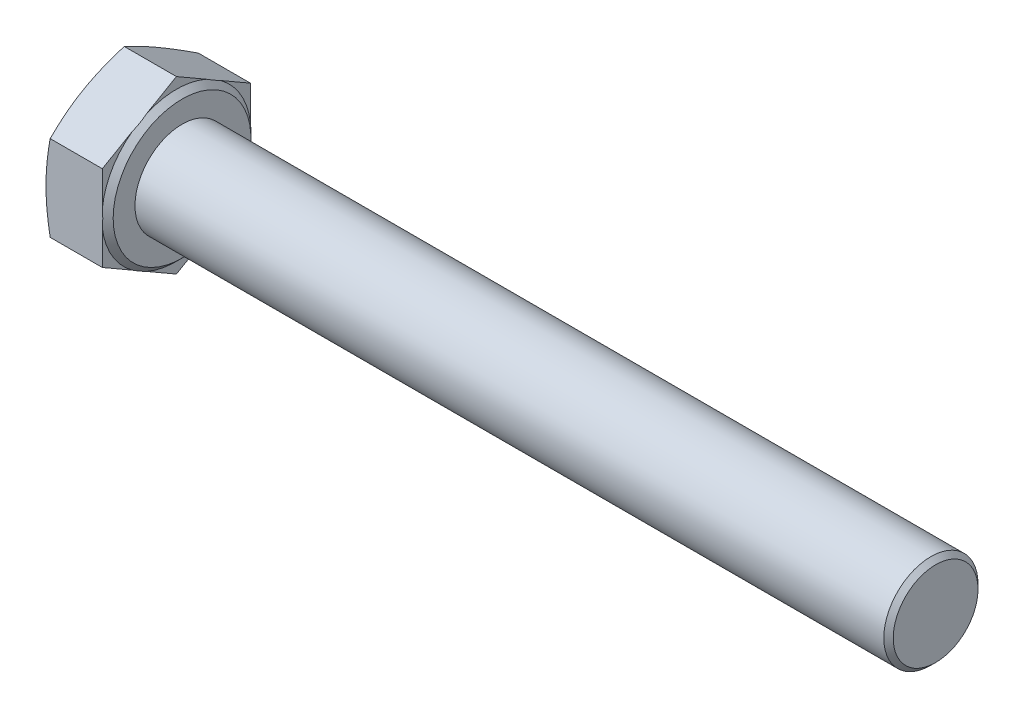
ISO-10303-21;
HEADER;
FILE_DESCRIPTION(('STEP AP214'),'2;1');
FILE_NAME('part.step','',(''),(''),'','','');
FILE_SCHEMA(('AUTOMOTIVE_DESIGN { 1 0 10303 214 1 1 1 1 }'));
ENDSEC;
DATA;
#1=APPLICATION_CONTEXT('core data for automotive mechanical design processes');
#2=APPLICATION_PROTOCOL_DEFINITION('international standard','automotive_design',2000,#1);
#3=PRODUCT_CONTEXT('',#1,'mechanical');
#4=PRODUCT('Part','Part','',(#3));
#5=PRODUCT_RELATED_PRODUCT_CATEGORY('part','',(#4));
#6=PRODUCT_DEFINITION_FORMATION('','',#4);
#7=PRODUCT_DEFINITION_CONTEXT('part definition',#1,'design');
#8=PRODUCT_DEFINITION('design','',#6,#7);
#9=PRODUCT_DEFINITION_SHAPE('','',#8);
#10=(LENGTH_UNIT() NAMED_UNIT(*) SI_UNIT(.MILLI.,.METRE.));
#11=(NAMED_UNIT(*) PLANE_ANGLE_UNIT() SI_UNIT($,.RADIAN.));
#12=(NAMED_UNIT(*) SI_UNIT($,.STERADIAN.) SOLID_ANGLE_UNIT());
#13=UNCERTAINTY_MEASURE_WITH_UNIT(LENGTH_MEASURE(1.E-05),#10,'distance_accuracy_value','');
#14=(GEOMETRIC_REPRESENTATION_CONTEXT(3) GLOBAL_UNCERTAINTY_ASSIGNED_CONTEXT((#13)) GLOBAL_UNIT_ASSIGNED_CONTEXT((#10,
#11,#12)) REPRESENTATION_CONTEXT('',''));
#15=CARTESIAN_POINT('',(0.,0.,0.));
#16=DIRECTION('',(0.,0.,1.));
#17=DIRECTION('',(1.,0.,0.));
#18=AXIS2_PLACEMENT_3D('',#15,#16,#17);
#19=CARTESIAN_POINT('',(6.58,-9.08171973435282,0.));
#20=DIRECTION('',(-1.,0.,0.));
#21=DIRECTION('',(0.,0.,1.));
#22=AXIS2_PLACEMENT_3D('',#19,#20,#21);
#23=PLANE('',#22);
#24=CARTESIAN_POINT('',(6.58,0.,0.));
#25=DIRECTION('',(-1.,0.,0.));
#26=DIRECTION('',(0.,0.,1.));
#27=AXIS2_PLACEMENT_3D('',#24,#25,#26);
#28=CIRCLE('',#27,7.315);
#29=CARTESIAN_POINT('',(6.58,0.,7.315));
#30=VERTEX_POINT('',#29);
#31=EDGE_CURVE('E506',#30,#30,#28,.T.);
#32=ORIENTED_EDGE('',*,*,#31,.F.);
#33=EDGE_LOOP('',(#32));
#34=FACE_BOUND('',#33,.T.);
#35=CARTESIAN_POINT('',(6.58,0.,0.));
#36=DIRECTION('',(-1.,0.,0.));
#37=DIRECTION('',(0.,0.,1.));
#38=AXIS2_PLACEMENT_3D('',#35,#36,#37);
#39=CIRCLE('',#38,5.);
#40=CARTESIAN_POINT('',(6.58,0.,5.));
#41=VERTEX_POINT('',#40);
#42=EDGE_CURVE('E189',#41,#41,#39,.F.);
#43=ORIENTED_EDGE('',*,*,#42,.F.);
#44=EDGE_LOOP('',(#43));
#45=FACE_BOUND('',#44,.T.);
#46=ADVANCED_FACE('F36',(#34,#45),#23,.F.);
#47=CARTESIAN_POINT('',(6.58,-9.08171973435282,0.));
#48=DIRECTION('',(0.,0.866025403784439,0.5));
#49=DIRECTION('',(0.,-0.5,0.866025403784439));
#50=AXIS2_PLACEMENT_3D('',#47,#48,#49);
#51=PLANE('',#50);
#52=CARTESIAN_POINT('',(0.442891795212777,-4.54074439712257,-7.8652));
#53=CARTESIAN_POINT('',(0.374419710513132,-4.72880090562985,-7.53947657257138));
#54=CARTESIAN_POINT('',(0.31213253527496,-4.91747753754728,-7.21267905988943));
#55=CARTESIAN_POINT('',(0.202547931744523,-5.2960575790076,-6.55695919334861));
#56=CARTESIAN_POINT('',(0.155262232707484,-5.48596183060646,-6.22803538100605));
#57=CARTESIAN_POINT('',(0.0787789851506862,-5.86488964065851,-5.57171316159509));
#58=CARTESIAN_POINT('',(0.0494146172511889,-6.05390454554577,-5.24432974294255));
#59=CARTESIAN_POINT('',(0.0100287510814292,-6.43237636216652,-4.58879732732252));
#60=CARTESIAN_POINT('',(0.,-6.62183308146557,-4.26064866366126));
#61=CARTESIAN_POINT('',(0.,-7.00074652006366,-3.60435133633874));
#62=CARTESIAN_POINT('',(0.0100287510814295,-7.1902032393627,-3.27620267267748));
#63=CARTESIAN_POINT('',(0.0494146172511893,-7.56867505598345,-2.62067025705744));
#64=CARTESIAN_POINT('',(0.0787789851506865,-7.75768996087072,-2.29328683840491));
#65=CARTESIAN_POINT('',(0.155262232707485,-8.13661777092277,-1.63696461899394));
#66=CARTESIAN_POINT('',(0.202547931744524,-8.32652202252162,-1.30804080665138));
#67=CARTESIAN_POINT('',(0.312132535274961,-8.70510206398195,-0.652320940110565));
#68=CARTESIAN_POINT('',(0.374419710513133,-8.89377869589937,-0.325523427428616));
#69=CARTESIAN_POINT('',(0.442891795212778,-9.08183520440666,0.000200000000004544));
#70=B_SPLINE_CURVE_WITH_KNOTS('',3,(#52,#53,#54,#55,#56,#57,#58,#59,#60,#61,#62,#63,#64,#65,#66,
#67,#68,#69),.UNSPECIFIED.,.F.,.F.,(4,2,2,2,2,2,2,2,4),(0.,1.14700314621245,2.29490090600088,
3.43194374910873,4.56856000315232,5.70517625719591,6.84221910030376,7.99011686009219,
9.13712000630464),.UNSPECIFIED.);
#71=CARTESIAN_POINT('',(0.442849766748697,-4.54085986717641,-7.865));
#72=VERTEX_POINT('',#71);
#73=CARTESIAN_POINT('',(0.,-6.81128980076461,-3.9325));
#74=VERTEX_POINT('',#73);
#75=EDGE_CURVE('E151',#72,#74,#70,.T.);
#76=ORIENTED_EDGE('',*,*,#75,.F.);
#77=DIRECTION('',(-1.,0.,0.));
#78=VECTOR('',#77,1.);
#79=CARTESIAN_POINT('',(6.58,-4.54085986717641,-7.865));
#80=LINE('',#79,#78);
#81=CARTESIAN_POINT('',(5.98,-4.54085986717641,-7.865));
#82=VERTEX_POINT('',#81);
#83=EDGE_CURVE('E180',#82,#72,#80,.T.);
#84=ORIENTED_EDGE('',*,*,#83,.F.);
#85=DIRECTION('',(0.,0.5,-0.866025403784439));
#86=VECTOR('',#85,1.);
#87=CARTESIAN_POINT('',(5.98,-9.08171973435282,0.));
#88=LINE('',#87,#86);
#89=CARTESIAN_POINT('',(5.98,-6.36716144094055,-4.70175288429751));
#90=VERTEX_POINT('',#89);
#91=EDGE_CURVE('E310',#90,#82,#88,.T.);
#92=ORIENTED_EDGE('',*,*,#91,.F.);
#93=CARTESIAN_POINT('',(5.9798,-7.25630835093978,-3.16170526078596));
#94=CARTESIAN_POINT('',(5.99646670915282,-7.18233435080143,-3.2898319874647));
#95=CARTESIAN_POINT('',(6.00903010165886,-7.10812502846129,-3.41836630415309));
#96=CARTESIAN_POINT('',(6.02578356494241,-6.95970657625886,-3.67543460414842));
#97=CARTESIAN_POINT('',(6.03,-6.88549818851173,-3.80396730207421));
#98=CARTESIAN_POINT('',(6.03,-6.73708141301749,-4.06103269792579));
#99=CARTESIAN_POINT('',(6.02578356494241,-6.66287302527036,-4.18956539585158));
#100=CARTESIAN_POINT('',(6.00903010165886,-6.51445457306794,-4.44663369584692));
#101=CARTESIAN_POINT('',(5.99646670915282,-6.44024525072779,-4.5751680125353));
#102=CARTESIAN_POINT('',(5.9798,-6.36627125058944,-4.70329473921404));
#103=B_SPLINE_CURVE_WITH_KNOTS('',3,(#93,#94,#95,#96,#97,#98,#99,#100,#101,#102),.UNSPECIFIED.,
.F.,.F.,(4,2,2,2,4),(0.,0.446607529504007,0.891802161815922,1.33699679412784,1.78360432363184),.UNSPECIFIED.);
#104=CARTESIAN_POINT('',(5.98,-7.25541816058868,-3.16324711570249));
#105=VERTEX_POINT('',#104);
#106=EDGE_CURVE('E297',#105,#90,#103,.T.);
#107=ORIENTED_EDGE('',*,*,#106,.F.);
#108=CARTESIAN_POINT('',(5.98,-9.08171973435282,0.));
#109=VERTEX_POINT('',#108);
#110=EDGE_CURVE('E307',#109,#105,#88,.T.);
#111=ORIENTED_EDGE('',*,*,#110,.F.);
#112=DIRECTION('',(-1.,0.,0.));
#113=VECTOR('',#112,1.);
#114=CARTESIAN_POINT('',(6.58,-9.08171973435282,0.));
#115=LINE('',#114,#113);
#116=CARTESIAN_POINT('',(0.442849766748697,-9.08171973435282,0.));
#117=VERTEX_POINT('',#116);
#118=EDGE_CURVE('E174',#109,#117,#115,.T.);
#119=ORIENTED_EDGE('',*,*,#118,.T.);
#120=EDGE_CURVE('E264',#74,#117,#70,.T.);
#121=ORIENTED_EDGE('',*,*,#120,.F.);
#122=EDGE_LOOP('',(#76,#84,#92,#107,#111,#119,#121));
#123=FACE_BOUND('',#122,.T.);
#124=ADVANCED_FACE('F205',(#123),#51,.F.);
#125=CARTESIAN_POINT('',(6.58,-4.54085986717641,-7.865));
#126=DIRECTION('',(0.,0.,1.));
#127=DIRECTION('',(0.,-1.,0.));
#128=AXIS2_PLACEMENT_3D('',#125,#126,#127);
#129=PLANE('',#128);
#130=CARTESIAN_POINT('',(2.36641352883534,-12.0226002521994,-7.865));
#131=CARTESIAN_POINT('',(2.2580600665346,-11.6667592108969,-7.865));
#132=CARTESIAN_POINT('',(2.15097094806915,-11.3105260197279,-7.865));
#133=CARTESIAN_POINT('',(1.94002083195681,-10.5970756919498,-7.865));
#134=CARTESIAN_POINT('',(1.83616008975262,-10.2398584799029,-7.865));
#135=CARTESIAN_POINT('',(1.63219338793846,-9.52362904909049,-7.865));
#136=CARTESIAN_POINT('',(1.53209479535907,-9.16461472477212,-7.865));
#137=CARTESIAN_POINT('',(1.33682427451146,-8.44525058341012,-7.865));
#138=CARTESIAN_POINT('',(1.24165225778545,-8.08490079046971,-7.865));
#139=CARTESIAN_POINT('',(1.0585905385423,-7.36707846156647,-7.865));
#140=CARTESIAN_POINT('',(0.970625516530099,-7.00962522951279,-7.865));
#141=CARTESIAN_POINT('',(0.802184639608978,-6.29294003205345,-7.865));
#142=CARTESIAN_POINT('',(0.721708910733726,-5.93370803682097,-7.865));
#143=CARTESIAN_POINT('',(0.570122836565261,-5.21338493122039,-7.865));
#144=CARTESIAN_POINT('',(0.499009296610734,-4.85229449893847,-7.865));
#145=CARTESIAN_POINT('',(0.368312985121941,-4.12801725415188,-7.865));
#146=CARTESIAN_POINT('',(0.308729827253167,-3.76483051230575,-7.865));
#147=CARTESIAN_POINT('',(0.209414441038813,-3.07725690165157,-7.865));
#148=CARTESIAN_POINT('',(0.168205546214481,-2.7530853328262,-7.865));
#149=CARTESIAN_POINT('',(0.0984487044914575,-2.10337143697526,-7.865));
#150=CARTESIAN_POINT('',(0.0699003886504234,-1.77782915017295,-7.865));
#151=CARTESIAN_POINT('',(0.0268395333928621,-1.12603413815281,-7.865));
#152=CARTESIAN_POINT('',(0.0123170662625508,-0.799782079500948,-7.865));
#153=CARTESIAN_POINT('',(-0.00195682196202667,-0.14695155409798,-7.865));
#154=CARTESIAN_POINT('',(-0.00170834736825185,0.179626910331775,-7.865));
#155=CARTESIAN_POINT('',(0.0135848305907238,0.834088605803915,-7.865));
#156=CARTESIAN_POINT('',(0.0287045666873488,1.1619700543289,-7.865));
#157=CARTESIAN_POINT('',(0.0730444535855844,1.81676988175852,-7.865));
#158=CARTESIAN_POINT('',(0.102264943148469,2.14368823733563,-7.865));
#159=CARTESIAN_POINT('',(0.173439416526264,2.79640045175945,-7.865));
#160=CARTESIAN_POINT('',(0.215404337365141,3.12219310070864,-7.865));
#161=CARTESIAN_POINT('',(0.310365462203543,3.77214853671123,-7.865));
#162=CARTESIAN_POINT('',(0.36336172532774,4.09631131501948,-7.865));
#163=CARTESIAN_POINT('',(0.481710366049259,4.76006524207303,-7.865));
#164=CARTESIAN_POINT('',(0.54756804831913,5.09956549095025,-7.865));
#165=CARTESIAN_POINT('',(0.68775969136854,5.77682257574967,-7.865));
#166=CARTESIAN_POINT('',(0.762094291182788,6.11457927822532,-7.865));
#167=CARTESIAN_POINT('',(0.917678889211969,6.78858995476071,-7.865));
#168=CARTESIAN_POINT('',(0.99893089580968,7.12484346235698,-7.865));
#169=CARTESIAN_POINT('',(1.16702859371564,7.79593398735149,-7.865));
#170=CARTESIAN_POINT('',(1.25387415094818,8.1307710384969,-7.865));
#171=CARTESIAN_POINT('',(1.43222777068835,8.79965725830403,-7.865));
#172=CARTESIAN_POINT('',(1.52374167778338,9.13370486288186,-7.865));
#173=CARTESIAN_POINT('',(1.71049239515709,9.80075635699058,-7.865));
#174=CARTESIAN_POINT('',(1.80572922122974,10.1337602420872,-7.865));
#175=CARTESIAN_POINT('',(1.99924297662574,10.7988194802628,-7.865));
#176=CARTESIAN_POINT('',(2.09751937989521,11.1308749867298,-7.865));
#177=CARTESIAN_POINT('',(2.29660417636339,11.7942269637766,-7.865));
#178=CARTESIAN_POINT('',(2.39741258611677,12.1255234293784,-7.865));
#179=CARTESIAN_POINT('',(2.70073124187539,13.1111316113962,-7.865));
#180=CARTESIAN_POINT('',(2.90629348400979,13.7645038967645,-7.865));
#181=CARTESIAN_POINT('',(3.32324319611831,15.0694121850919,-7.865));
#182=CARTESIAN_POINT('',(3.53463094557802,15.7209480982901,-7.865));
#183=CARTESIAN_POINT('',(3.96086805240708,17.0201471473339,-7.865));
#184=CARTESIAN_POINT('',(4.17570123192526,17.6678155976447,-7.865));
#185=CARTESIAN_POINT('',(4.50033413441196,18.6384901456375,-7.865));
#186=CARTESIAN_POINT('',(4.60893786794372,18.9618972960534,-7.865));
#187=CARTESIAN_POINT('',(4.82684807618741,19.6084739186475,-7.865));
#188=CARTESIAN_POINT('',(4.93615454918639,19.9316433914029,-7.865));
#189=CARTESIAN_POINT('',(5.04576544996388,20.2547096296475,-7.865));
#190=B_SPLINE_CURVE_WITH_KNOTS('',3,(#130,#131,#132,#133,#134,#135,#136,#137,#138,#139,#140,
#141,#142,#143,#144,#145,#146,#147,#148,#149,#150,#151,#152,#153,#154,#155,#156,#157,#158,#159,
#160,#161,#162,#163,#164,#165,#166,#167,#168,#169,#170,#171,#172,#173,#174,#175,#176,#177,#178,
#179,#180,#181,#182,#183,#184,#185,#186,#187,#188,#189),.UNSPECIFIED.,.F.,.F.,(4,2,2,2,2,2,2,2,
2,2,2,2,2,2,2,2,2,2,2,2,2,2,2,2,2,2,2,2,2,4),(0.,1.11592451335134,2.23193709973416,
3.35003188749546,4.46810659263983,5.57239601256039,6.67670401267008,7.78063420744246,
8.88452740776003,9.86465314915734,10.8447503268016,11.8241532668998,12.8035492904839,
13.7879123241796,14.7722990077235,15.7575328715573,16.7427720160839,17.78012614953,
18.8175585359564,19.8552931619037,20.8930029229185,21.932045362512,22.971092210578,
24.0099602280774,25.0488350396308,27.1036289647327,29.1585216432028,31.2056173678942,
32.2290827778725,33.2525456940577),.UNSPECIFIED.);
#191=CARTESIAN_POINT('',(0.442849766748697,4.54085986717641,-7.865));
#192=VERTEX_POINT('',#191);
#193=CARTESIAN_POINT('',(0.,0.,-7.865));
#194=VERTEX_POINT('',#193);
#195=EDGE_CURVE('E276',#192,#194,#190,.F.);
#196=ORIENTED_EDGE('',*,*,#195,.F.);
#197=DIRECTION('',(-1.,0.,0.));
#198=VECTOR('',#197,1.);
#199=CARTESIAN_POINT('',(6.58,4.54085986717641,-7.865));
#200=LINE('',#199,#198);
#201=CARTESIAN_POINT('',(5.98,4.54085986717641,-7.865));
#202=VERTEX_POINT('',#201);
#203=EDGE_CURVE('E171',#202,#192,#200,.T.);
#204=ORIENTED_EDGE('',*,*,#203,.F.);
#205=DIRECTION('',(0.,1.,0.));
#206=VECTOR('',#205,1.);
#207=CARTESIAN_POINT('',(5.98,-4.54085986717641,-7.865));
#208=LINE('',#207,#206);
#209=CARTESIAN_POINT('',(5.98,0.88825671964814,-7.865));
#210=VERTEX_POINT('',#209);
#211=EDGE_CURVE('E318',#210,#202,#208,.T.);
#212=ORIENTED_EDGE('',*,*,#211,.F.);
#213=CARTESIAN_POINT('',(4.95281448287955,-4.25493323362413,-7.865));
#214=CARTESIAN_POINT('',(5.07224674422361,-4.00381767979159,-7.865));
#215=CARTESIAN_POINT('',(5.1852007071726,-3.74935435711382,-7.865));
#216=CARTESIAN_POINT('',(5.39477690609979,-3.23290692572169,-7.865));
#217=CARTESIAN_POINT('',(5.49134731670986,-2.97090190905984,-7.865));
#218=CARTESIAN_POINT('',(5.66341320093298,-2.44188823017792,-7.865));
#219=CARTESIAN_POINT('',(5.7390458683139,-2.17492499451166,-7.865));
#220=CARTESIAN_POINT('',(5.86601117735481,-1.6355184072639,-7.865));
#221=CARTESIAN_POINT('',(5.91737529329116,-1.36308263409081,-7.865));
#222=CARTESIAN_POINT('',(5.98170365844323,-0.894044676460958,-7.865));
#223=CARTESIAN_POINT('',(6.0014844739477,-0.698365723329963,-7.865));
#224=CARTESIAN_POINT('',(6.02648132847238,-0.306035610110695,-7.865));
#225=CARTESIAN_POINT('',(6.03169564403578,-0.109384337738237,-7.865));
#226=CARTESIAN_POINT('',(6.02733646784886,0.283885883127007,-7.865));
#227=CARTESIAN_POINT('',(6.01775297726552,0.480504719906106,-7.865));
#228=CARTESIAN_POINT('',(5.98416907487251,0.872456949445739,-7.865));
#229=CARTESIAN_POINT('',(5.96017040747733,1.06779049485143,-7.865));
#230=CARTESIAN_POINT('',(5.88319291404413,1.55355431244837,-7.865));
#231=CARTESIAN_POINT('',(5.82172156211772,1.84265691326911,-7.865));
#232=CARTESIAN_POINT('',(5.67244236510524,2.41426382178008,-7.865));
#233=CARTESIAN_POINT('',(5.58459433393685,2.69675734726315,-7.865));
#234=CARTESIAN_POINT('',(5.38697042620144,3.25528983169128,-7.865));
#235=CARTESIAN_POINT('',(5.27709906873763,3.53129462565731,-7.865));
#236=CARTESIAN_POINT('',(5.09956194454999,3.93908690549662,-7.865));
#237=CARTESIAN_POINT('',(5.03837569368458,4.07375872223425,-7.865));
#238=CARTESIAN_POINT('',(4.91219062578649,4.34125726474725,-7.865));
#239=CARTESIAN_POINT('',(4.8471929563225,4.47408453114661,-7.865));
#240=CARTESIAN_POINT('',(4.78050524465145,4.60606010005043,-7.865));
#241=B_SPLINE_CURVE_WITH_KNOTS('',3,(#213,#214,#215,#216,#217,#218,#219,#220,#221,#222,#223,
#224,#225,#226,#227,#228,#229,#230,#231,#232,#233,#234,#235,#236,#237,#238,#239,#240),
.UNSPECIFIED.,.F.,.F.,(4,2,2,2,2,2,2,2,2,2,2,2,2,4),(0.,0.834481732062271,1.67155582149863,
2.50300768684546,3.33337824868056,3.92290979018692,4.51251108002938,5.10251093605802,
5.69243940919473,6.57758291183943,7.46408187376857,8.35451073181988,8.79822291544168,
9.24180218228584),.UNSPECIFIED.);
#242=CARTESIAN_POINT('',(5.98,-0.888256719648143,-7.865));
#243=VERTEX_POINT('',#242);
#244=EDGE_CURVE('E291',#243,#210,#241,.T.);
#245=ORIENTED_EDGE('',*,*,#244,.F.);
#246=EDGE_CURVE('E319',#82,#243,#208,.T.);
#247=ORIENTED_EDGE('',*,*,#246,.F.);
#248=ORIENTED_EDGE('',*,*,#83,.T.);
#249=EDGE_CURVE('E162',#194,#72,#190,.F.);
#250=ORIENTED_EDGE('',*,*,#249,.F.);
#251=EDGE_LOOP('',(#196,#204,#212,#245,#247,#248,#250));
#252=FACE_BOUND('',#251,.T.);
#253=ADVANCED_FACE('F211',(#252),#129,.F.);
#254=CARTESIAN_POINT('',(6.58,4.54085986717641,-7.865));
#255=DIRECTION('',(0.,-0.866025403784439,0.5));
#256=DIRECTION('',(0.,-0.5,-0.866025403784439));
#257=AXIS2_PLACEMENT_3D('',#254,#255,#256);
#258=PLANE('',#257);
#259=CARTESIAN_POINT('',(0.442891795212778,9.08183520440665,0.000199999999997652));
#260=CARTESIAN_POINT('',(0.374419710513132,8.89377869589937,-0.325523427428622));
#261=CARTESIAN_POINT('',(0.31213253527496,8.70510206398195,-0.652320940110571));
#262=CARTESIAN_POINT('',(0.202547931744524,8.32652202252162,-1.30804080665139));
#263=CARTESIAN_POINT('',(0.155262232707485,8.13661777092277,-1.63696461899395));
#264=CARTESIAN_POINT('',(0.0787789851506868,7.75768996087071,-2.29328683840491));
#265=CARTESIAN_POINT('',(0.0494146172511894,7.56867505598345,-2.62067025705745));
#266=CARTESIAN_POINT('',(0.0100287510814296,7.1902032393627,-3.27620267267749));
#267=CARTESIAN_POINT('',(0.,7.00074652006365,-3.60435133633874));
#268=CARTESIAN_POINT('',(0.,6.62183308146557,-4.26064866366126));
#269=CARTESIAN_POINT('',(0.0100287510814301,6.43237636216652,-4.58879732732252));
#270=CARTESIAN_POINT('',(0.0494146172511897,6.05390454554577,-5.24432974294256));
#271=CARTESIAN_POINT('',(0.0787789851506866,5.86488964065851,-5.57171316159509));
#272=CARTESIAN_POINT('',(0.155262232707485,5.48596183060645,-6.22803538100606));
#273=CARTESIAN_POINT('',(0.202547931744524,5.2960575790076,-6.55695919334862));
#274=CARTESIAN_POINT('',(0.31213253527496,4.91747753754727,-7.21267905988943));
#275=CARTESIAN_POINT('',(0.374419710513132,4.72880090562985,-7.53947657257138));
#276=CARTESIAN_POINT('',(0.442891795212777,4.54074439712257,-7.8652));
#277=B_SPLINE_CURVE_WITH_KNOTS('',3,(#259,#260,#261,#262,#263,#264,#265,#266,#267,#268,#269,
#270,#271,#272,#273,#274,#275,#276),.UNSPECIFIED.,.F.,.F.,(4,2,2,2,2,2,2,2,4),(0.,
1.14700314621245,2.29490090600088,3.43194374910873,4.56856000315232,5.70517625719591,
6.84221910030376,7.99011686009219,9.13712000630464),.UNSPECIFIED.);
#278=CARTESIAN_POINT('',(0.442849766748697,9.08171973435282,0.));
#279=VERTEX_POINT('',#278);
#280=CARTESIAN_POINT('',(0.,6.81128980076461,-3.9325));
#281=VERTEX_POINT('',#280);
#282=EDGE_CURVE('E514',#279,#281,#277,.T.);
#283=ORIENTED_EDGE('',*,*,#282,.F.);
#284=DIRECTION('',(-1.,0.,0.));
#285=VECTOR('',#284,1.);
#286=CARTESIAN_POINT('',(6.58,9.08171973435281,0.));
#287=LINE('',#286,#285);
#288=CARTESIAN_POINT('',(5.98,9.08171973435282,0.));
#289=VERTEX_POINT('',#288);
#290=EDGE_CURVE('E168',#289,#279,#287,.T.);
#291=ORIENTED_EDGE('',*,*,#290,.F.);
#292=DIRECTION('',(0.,0.5,0.866025403784439));
#293=VECTOR('',#292,1.);
#294=CARTESIAN_POINT('',(5.98,4.54085986717641,-7.865));
#295=LINE('',#294,#293);
#296=CARTESIAN_POINT('',(5.98,7.25541816058867,-3.16324711570249));
#297=VERTEX_POINT('',#296);
#298=EDGE_CURVE('E315',#297,#289,#295,.T.);
#299=ORIENTED_EDGE('',*,*,#298,.F.);
#300=CARTESIAN_POINT('',(5.9798,6.36627125058944,-4.70329473921403));
#301=CARTESIAN_POINT('',(5.99646670915282,6.4402452507278,-4.57516801253529));
#302=CARTESIAN_POINT('',(6.00903010165886,6.51445457306794,-4.44663369584691));
#303=CARTESIAN_POINT('',(6.02578356494241,6.66287302527037,-4.18956539585158));
#304=CARTESIAN_POINT('',(6.03,6.73708141301749,-4.06103269792579));
#305=CARTESIAN_POINT('',(6.03,6.88549818851174,-3.80396730207421));
#306=CARTESIAN_POINT('',(6.0257835649424,6.95970657625886,-3.67543460414842));
#307=CARTESIAN_POINT('',(6.00903010165886,7.10812502846128,-3.41836630415309));
#308=CARTESIAN_POINT('',(5.99646670915282,7.18233435080143,-3.28983198746471));
#309=CARTESIAN_POINT('',(5.9798,7.25630835093978,-3.16170526078597));
#310=B_SPLINE_CURVE_WITH_KNOTS('',3,(#300,#301,#302,#303,#304,#305,#306,#307,#308,#309),
.UNSPECIFIED.,.F.,.F.,(4,2,2,2,4),(0.,0.446607529504003,0.891802161815913,1.33699679412782,
1.78360432363183),.UNSPECIFIED.);
#311=CARTESIAN_POINT('',(5.98,6.36716144094055,-4.70175288429751));
#312=VERTEX_POINT('',#311);
#313=EDGE_CURVE('E298',#312,#297,#310,.T.);
#314=ORIENTED_EDGE('',*,*,#313,.F.);
#315=EDGE_CURVE('E317',#202,#312,#295,.T.);
#316=ORIENTED_EDGE('',*,*,#315,.F.);
#317=ORIENTED_EDGE('',*,*,#203,.T.);
#318=EDGE_CURVE('E277',#281,#192,#277,.T.);
#319=ORIENTED_EDGE('',*,*,#318,.F.);
#320=EDGE_LOOP('',(#283,#291,#299,#314,#316,#317,#319));
#321=FACE_BOUND('',#320,.T.);
#322=ADVANCED_FACE('F285',(#321),#258,.F.);
#323=CARTESIAN_POINT('',(6.58,9.08171973435281,0.));
#324=DIRECTION('',(0.,-0.866025403784439,-0.5));
#325=DIRECTION('',(0.,0.5,-0.866025403784439));
#326=AXIS2_PLACEMENT_3D('',#323,#324,#325);
#327=PLANE('',#326);
#328=CARTESIAN_POINT('',(0.442891795212778,4.54074439712257,7.8652));
#329=CARTESIAN_POINT('',(0.374419710513133,4.72880090562985,7.53947657257138));
#330=CARTESIAN_POINT('',(0.312132535274961,4.91747753754728,7.21267905988943));
#331=CARTESIAN_POINT('',(0.202547931744524,5.2960575790076,6.55695919334861));
#332=CARTESIAN_POINT('',(0.155262232707484,5.48596183060646,6.22803538100606));
#333=CARTESIAN_POINT('',(0.0787789851506865,5.86488964065851,5.57171316159509));
#334=CARTESIAN_POINT('',(0.0494146172511896,6.05390454554577,5.24432974294255));
#335=CARTESIAN_POINT('',(0.0100287510814301,6.43237636216652,4.58879732732252));
#336=CARTESIAN_POINT('',(0.,6.62183308146557,4.26064866366126));
#337=CARTESIAN_POINT('',(0.,7.00074652006366,3.60435133633874));
#338=CARTESIAN_POINT('',(0.0100287510814298,7.1902032393627,3.27620267267748));
#339=CARTESIAN_POINT('',(0.0494146172511894,7.56867505598345,2.62067025705745));
#340=CARTESIAN_POINT('',(0.0787789851506865,7.75768996087072,2.29328683840491));
#341=CARTESIAN_POINT('',(0.155262232707484,8.13661777092277,1.63696461899394));
#342=CARTESIAN_POINT('',(0.202547931744523,8.32652202252162,1.30804080665138));
#343=CARTESIAN_POINT('',(0.31213253527496,8.70510206398195,0.652320940110566));
#344=CARTESIAN_POINT('',(0.374419710513132,8.89377869589937,0.325523427428618));
#345=CARTESIAN_POINT('',(0.442891795212778,9.08183520440665,-0.000200000000002684));
#346=B_SPLINE_CURVE_WITH_KNOTS('',3,(#328,#329,#330,#331,#332,#333,#334,#335,#336,#337,#338,
#339,#340,#341,#342,#343,#344,#345),.UNSPECIFIED.,.F.,.F.,(4,2,2,2,2,2,2,2,4),(0.,
1.14700314621245,2.29490090600088,3.43194374910872,4.56856000315232,5.70517625719591,
6.84221910030376,7.99011686009219,9.13712000630464),.UNSPECIFIED.);
#347=CARTESIAN_POINT('',(0.442849766748697,4.54085986717641,7.865));
#348=VERTEX_POINT('',#347);
#349=CARTESIAN_POINT('',(0.,6.81128980076461,3.9325));
#350=VERTEX_POINT('',#349);
#351=EDGE_CURVE('E146',#348,#350,#346,.T.);
#352=ORIENTED_EDGE('',*,*,#351,.F.);
#353=DIRECTION('',(-1.,0.,0.));
#354=VECTOR('',#353,1.);
#355=CARTESIAN_POINT('',(6.58,4.54085986717641,7.865));
#356=LINE('',#355,#354);
#357=CARTESIAN_POINT('',(5.98,4.54085986717641,7.865));
#358=VERTEX_POINT('',#357);
#359=EDGE_CURVE('E159',#358,#348,#356,.T.);
#360=ORIENTED_EDGE('',*,*,#359,.F.);
#361=DIRECTION('',(0.,-0.5,0.866025403784439));
#362=VECTOR('',#361,1.);
#363=CARTESIAN_POINT('',(5.98,9.08171973435281,0.));
#364=LINE('',#363,#362);
#365=CARTESIAN_POINT('',(5.98,6.36716144094055,4.70175288429751));
#366=VERTEX_POINT('',#365);
#367=EDGE_CURVE('E312',#366,#358,#364,.T.);
#368=ORIENTED_EDGE('',*,*,#367,.F.);
#369=CARTESIAN_POINT('',(5.9798,7.25630835093979,3.16170526078595));
#370=CARTESIAN_POINT('',(5.99646670915282,7.18233435080142,3.28983198746471));
#371=CARTESIAN_POINT('',(6.00903010165886,7.10812502846127,3.41836630415311));
#372=CARTESIAN_POINT('',(6.02578356494241,6.95970657625882,3.67543460414849));
#373=CARTESIAN_POINT('',(6.03000000000001,6.88549818851169,3.8039673020743));
#374=CARTESIAN_POINT('',(6.03,6.73708141301742,4.06103269792592));
#375=CARTESIAN_POINT('',(6.0257835649424,6.66287302527028,4.18956539585172));
#376=CARTESIAN_POINT('',(6.00903010165885,6.51445457306783,4.4466336958471));
#377=CARTESIAN_POINT('',(5.9964667091528,6.44024525072768,4.5751680125355));
#378=CARTESIAN_POINT('',(5.97979999999997,6.36627125058931,4.70329473921426));
#379=B_SPLINE_CURVE_WITH_KNOTS('',3,(#369,#370,#371,#372,#373,#374,#375,#376,#377,#378),
.UNSPECIFIED.,.F.,.F.,(4,2,2,2,4),(0.,0.446607529504072,0.891802161816054,1.33699679412803,
1.78360432363211),.UNSPECIFIED.);
#380=CARTESIAN_POINT('',(5.98,7.25541816058868,3.16324711570249));
#381=VERTEX_POINT('',#380);
#382=EDGE_CURVE('E353',#381,#366,#379,.T.);
#383=ORIENTED_EDGE('',*,*,#382,.F.);
#384=EDGE_CURVE('E314',#289,#381,#364,.T.);
#385=ORIENTED_EDGE('',*,*,#384,.F.);
#386=ORIENTED_EDGE('',*,*,#290,.T.);
#387=EDGE_CURVE('E161',#350,#279,#346,.T.);
#388=ORIENTED_EDGE('',*,*,#387,.F.);
#389=EDGE_LOOP('',(#352,#360,#368,#383,#385,#386,#388));
#390=FACE_BOUND('',#389,.T.);
#391=ADVANCED_FACE('F157',(#390),#327,.F.);
#392=CARTESIAN_POINT('',(6.58,4.54085986717641,7.865));
#393=DIRECTION('',(0.,0.,-1.));
#394=DIRECTION('',(-1.,0.,0.));
#395=AXIS2_PLACEMENT_3D('',#392,#393,#394);
#396=PLANE('',#395);
#397=CARTESIAN_POINT('',(2.36641352883534,-12.0226002521994,7.865));
#398=CARTESIAN_POINT('',(2.2580600665346,-11.6667592108969,7.865));
#399=CARTESIAN_POINT('',(2.15097094806915,-11.3105260197279,7.865));
#400=CARTESIAN_POINT('',(1.94002083195681,-10.5970756919498,7.865));
#401=CARTESIAN_POINT('',(1.83616008975262,-10.2398584799029,7.865));
#402=CARTESIAN_POINT('',(1.63219338793846,-9.52362904909049,7.865));
#403=CARTESIAN_POINT('',(1.53209479535907,-9.16461472477212,7.865));
#404=CARTESIAN_POINT('',(1.33682427451146,-8.44525058341012,7.865));
#405=CARTESIAN_POINT('',(1.24165225778545,-8.08490079046971,7.865));
#406=CARTESIAN_POINT('',(1.05859053854231,-7.36707846156647,7.865));
#407=CARTESIAN_POINT('',(0.9706255165301,-7.00962522951279,7.865));
#408=CARTESIAN_POINT('',(0.802184639608979,-6.29294003205345,7.865));
#409=CARTESIAN_POINT('',(0.721708910733728,-5.93370803682097,7.865));
#410=CARTESIAN_POINT('',(0.570122836565263,-5.21338493122039,7.865));
#411=CARTESIAN_POINT('',(0.499009296610735,-4.85229449893848,7.865));
#412=CARTESIAN_POINT('',(0.368312985121942,-4.12801725415188,7.865));
#413=CARTESIAN_POINT('',(0.308729827253168,-3.76483051230575,7.865));
#414=CARTESIAN_POINT('',(0.209414441038814,-3.07725690165157,7.865));
#415=CARTESIAN_POINT('',(0.168205546214482,-2.7530853328262,7.865));
#416=CARTESIAN_POINT('',(0.098448704491458,-2.10337143697526,7.865));
#417=CARTESIAN_POINT('',(0.0699003886504238,-1.77782915017295,7.865));
#418=CARTESIAN_POINT('',(0.0268395333928625,-1.12603413815281,7.865));
#419=CARTESIAN_POINT('',(0.0123170662625512,-0.799782079500948,7.865));
#420=CARTESIAN_POINT('',(-0.00195682196202636,-0.14695155409798,7.865));
#421=CARTESIAN_POINT('',(-0.00170834736825153,0.179626910331776,7.865));
#422=CARTESIAN_POINT('',(0.013584830590724,0.834088605803916,7.865));
#423=CARTESIAN_POINT('',(0.0287045666873489,1.1619700543289,7.865));
#424=CARTESIAN_POINT('',(0.0730444535855847,1.81676988175852,7.865));
#425=CARTESIAN_POINT('',(0.10226494314847,2.14368823733563,7.865));
#426=CARTESIAN_POINT('',(0.173439416526265,2.79640045175946,7.865));
#427=CARTESIAN_POINT('',(0.215404337365142,3.12219310070864,7.865));
#428=CARTESIAN_POINT('',(0.310365462203544,3.77214853671123,7.865));
#429=CARTESIAN_POINT('',(0.363361725327741,4.09631131501948,7.865));
#430=CARTESIAN_POINT('',(0.48171036604926,4.76006524207303,7.865));
#431=CARTESIAN_POINT('',(0.54756804831913,5.09956549095025,7.865));
#432=CARTESIAN_POINT('',(0.687759691368539,5.77682257574967,7.865));
#433=CARTESIAN_POINT('',(0.762094291182787,6.11457927822532,7.865));
#434=CARTESIAN_POINT('',(0.917678889211968,6.78858995476071,7.865));
#435=CARTESIAN_POINT('',(0.998930895809679,7.12484346235697,7.865));
#436=CARTESIAN_POINT('',(1.16702859371564,7.79593398735149,7.865));
#437=CARTESIAN_POINT('',(1.25387415094818,8.1307710384969,7.865));
#438=CARTESIAN_POINT('',(1.43222777068835,8.79965725830403,7.865));
#439=CARTESIAN_POINT('',(1.52374167778338,9.13370486288185,7.865));
#440=CARTESIAN_POINT('',(1.71049239515709,9.80075635699057,7.865));
#441=CARTESIAN_POINT('',(1.80572922122974,10.1337602420872,7.865));
#442=CARTESIAN_POINT('',(1.99924297662574,10.7988194802628,7.865));
#443=CARTESIAN_POINT('',(2.09751937989521,11.1308749867297,7.865));
#444=CARTESIAN_POINT('',(2.29660417636339,11.7942269637766,7.865));
#445=CARTESIAN_POINT('',(2.39741258611677,12.1255234293784,7.865));
#446=CARTESIAN_POINT('',(2.70073124187539,13.1111316113962,7.865));
#447=CARTESIAN_POINT('',(2.90629348400979,13.7645038967645,7.865));
#448=CARTESIAN_POINT('',(3.32324319611831,15.0694121850919,7.865));
#449=CARTESIAN_POINT('',(3.53463094557802,15.7209480982901,7.865));
#450=CARTESIAN_POINT('',(3.96086805240708,17.0201471473339,7.865));
#451=CARTESIAN_POINT('',(4.17570123192526,17.6678155976447,7.865));
#452=CARTESIAN_POINT('',(4.50033413441195,18.6384901456375,7.865));
#453=CARTESIAN_POINT('',(4.60893786794372,18.9618972960534,7.865));
#454=CARTESIAN_POINT('',(4.82684807618741,19.6084739186475,7.865));
#455=CARTESIAN_POINT('',(4.93615454918639,19.9316433914029,7.865));
#456=CARTESIAN_POINT('',(5.04576544996388,20.2547096296475,7.865));
#457=B_SPLINE_CURVE_WITH_KNOTS('',3,(#397,#398,#399,#400,#401,#402,#403,#404,#405,#406,#407,
#408,#409,#410,#411,#412,#413,#414,#415,#416,#417,#418,#419,#420,#421,#422,#423,#424,#425,#426,
#427,#428,#429,#430,#431,#432,#433,#434,#435,#436,#437,#438,#439,#440,#441,#442,#443,#444,#445,
#446,#447,#448,#449,#450,#451,#452,#453,#454,#455,#456),.UNSPECIFIED.,.F.,.F.,(4,2,2,2,2,2,2,2,
2,2,2,2,2,2,2,2,2,2,2,2,2,2,2,2,2,2,2,2,2,4),(0.,1.11592451335134,2.23193709973416,
3.35003188749545,4.46810659263983,5.57239601256039,6.67670401267008,7.78063420744246,
8.88452740776003,9.86465314915734,10.8447503268016,11.8241532668998,12.8035492904838,
13.7879123241796,14.7722990077234,15.7575328715573,16.7427720160839,17.78012614953,
18.8175585359564,19.8552931619037,20.8930029229185,21.932045362512,22.971092210578,
24.0099602280774,25.0488350396308,27.1036289647327,29.1585216432028,31.2056173678942,
32.2290827778725,33.2525456940577),.UNSPECIFIED.);
#458=CARTESIAN_POINT('',(0.442849766748697,-4.54085986717641,7.865));
#459=VERTEX_POINT('',#458);
#460=CARTESIAN_POINT('',(0.,0.,7.865));
#461=VERTEX_POINT('',#460);
#462=EDGE_CURVE('E153',#459,#461,#457,.T.);
#463=ORIENTED_EDGE('',*,*,#462,.F.);
#464=DIRECTION('',(-1.,0.,0.));
#465=VECTOR('',#464,1.);
#466=CARTESIAN_POINT('',(6.58,-4.54085986717641,7.865));
#467=LINE('',#466,#465);
#468=CARTESIAN_POINT('',(5.98,-4.54085986717641,7.865));
#469=VERTEX_POINT('',#468);
#470=EDGE_CURVE('E169',#469,#459,#467,.T.);
#471=ORIENTED_EDGE('',*,*,#470,.F.);
#472=DIRECTION('',(0.,-1.,0.));
#473=VECTOR('',#472,1.);
#474=CARTESIAN_POINT('',(5.98,4.54085986717641,7.865));
#475=LINE('',#474,#473);
#476=CARTESIAN_POINT('',(5.98,-0.888256719648141,7.865));
#477=VERTEX_POINT('',#476);
#478=EDGE_CURVE('E309',#477,#469,#475,.T.);
#479=ORIENTED_EDGE('',*,*,#478,.F.);
#480=CARTESIAN_POINT('',(4.95281448287954,-4.25493323362413,7.865));
#481=CARTESIAN_POINT('',(5.07224674422361,-4.00381767979159,7.865));
#482=CARTESIAN_POINT('',(5.1852007071726,-3.74935435711382,7.865));
#483=CARTESIAN_POINT('',(5.39477690609979,-3.23290692572169,7.865));
#484=CARTESIAN_POINT('',(5.49134731670986,-2.97090190905984,7.865));
#485=CARTESIAN_POINT('',(5.66341320093298,-2.44188823017792,7.865));
#486=CARTESIAN_POINT('',(5.7390458683139,-2.17492499451166,7.865));
#487=CARTESIAN_POINT('',(5.86601117735481,-1.6355184072639,7.865));
#488=CARTESIAN_POINT('',(5.91737529329116,-1.36308263409081,7.865));
#489=CARTESIAN_POINT('',(5.98170365844323,-0.894044676460957,7.865));
#490=CARTESIAN_POINT('',(6.00148447394769,-0.698365723329963,7.865));
#491=CARTESIAN_POINT('',(6.02648132847238,-0.306035610110695,7.865));
#492=CARTESIAN_POINT('',(6.03169564403578,-0.109384337738236,7.865));
#493=CARTESIAN_POINT('',(6.02733646784886,0.283885883127008,7.865));
#494=CARTESIAN_POINT('',(6.01775297726552,0.480504719906106,7.865));
#495=CARTESIAN_POINT('',(5.98416907487251,0.872456949445739,7.865));
#496=CARTESIAN_POINT('',(5.96017040747733,1.06779049485143,7.865));
#497=CARTESIAN_POINT('',(5.88319291404413,1.55355431244838,7.865));
#498=CARTESIAN_POINT('',(5.82172156211772,1.84265691326911,7.865));
#499=CARTESIAN_POINT('',(5.67244236510524,2.41426382178008,7.865));
#500=CARTESIAN_POINT('',(5.58459433393685,2.69675734726316,7.865));
#501=CARTESIAN_POINT('',(5.38697042620144,3.25528983169129,7.865));
#502=CARTESIAN_POINT('',(5.27709906873763,3.53129462565732,7.865));
#503=CARTESIAN_POINT('',(5.09956194454999,3.93908690549662,7.865));
#504=CARTESIAN_POINT('',(5.03837569368458,4.07375872223425,7.865));
#505=CARTESIAN_POINT('',(4.91219062578649,4.34125726474726,7.865));
#506=CARTESIAN_POINT('',(4.8471929563225,4.47408453114661,7.865));
#507=CARTESIAN_POINT('',(4.78050524465145,4.60606010005043,7.865));
#508=B_SPLINE_CURVE_WITH_KNOTS('',3,(#480,#481,#482,#483,#484,#485,#486,#487,#488,#489,#490,
#491,#492,#493,#494,#495,#496,#497,#498,#499,#500,#501,#502,#503,#504,#505,#506,#507),
.UNSPECIFIED.,.F.,.F.,(4,2,2,2,2,2,2,2,2,2,2,2,2,4),(0.,0.834481732062273,1.67155582149863,
2.50300768684546,3.33337824868057,3.92290979018692,4.51251108002938,5.10251093605802,
5.69243940919473,6.57758291183943,7.46408187376857,8.35451073181988,8.79822291544169,
9.24180218228584),.UNSPECIFIED.);
#509=CARTESIAN_POINT('',(5.98,0.888256719648141,7.865));
#510=VERTEX_POINT('',#509);
#511=EDGE_CURVE('E354',#510,#477,#508,.F.);
#512=ORIENTED_EDGE('',*,*,#511,.F.);
#513=EDGE_CURVE('E167',#358,#510,#475,.T.);
#514=ORIENTED_EDGE('',*,*,#513,.F.);
#515=ORIENTED_EDGE('',*,*,#359,.T.);
#516=EDGE_CURVE('E143',#461,#348,#457,.T.);
#517=ORIENTED_EDGE('',*,*,#516,.F.);
#518=EDGE_LOOP('',(#463,#471,#479,#512,#514,#515,#517));
#519=FACE_BOUND('',#518,.T.);
#520=ADVANCED_FACE('F165',(#519),#396,.F.);
#521=CARTESIAN_POINT('',(6.58,-4.54085986717641,7.865));
#522=DIRECTION('',(0.,0.866025403784438,-0.5));
#523=DIRECTION('',(0.,0.5,0.866025403784439));
#524=AXIS2_PLACEMENT_3D('',#521,#522,#523);
#525=PLANE('',#524);
#526=CARTESIAN_POINT('',(0.442891795212779,-9.08183520440666,-0.000199999999995827));
#527=CARTESIAN_POINT('',(0.374419710513133,-8.89377869589937,0.325523427428625));
#528=CARTESIAN_POINT('',(0.312132535274961,-8.70510206398195,0.652320940110573));
#529=CARTESIAN_POINT('',(0.202547931744524,-8.32652202252162,1.30804080665139));
#530=CARTESIAN_POINT('',(0.155262232707485,-8.13661777092277,1.63696461899395));
#531=CARTESIAN_POINT('',(0.0787789851506873,-7.75768996087072,2.29328683840491));
#532=CARTESIAN_POINT('',(0.04941461725119,-7.56867505598345,2.62067025705745));
#533=CARTESIAN_POINT('',(0.0100287510814303,-7.1902032393627,3.27620267267749));
#534=CARTESIAN_POINT('',(0.,-7.00074652006366,3.60435133633874));
#535=CARTESIAN_POINT('',(0.,-6.62183308146557,4.26064866366126));
#536=CARTESIAN_POINT('',(0.0100287510814301,-6.43237636216652,4.58879732732252));
#537=CARTESIAN_POINT('',(0.0494146172511895,-6.05390454554577,5.24432974294256));
#538=CARTESIAN_POINT('',(0.0787789851506866,-5.86488964065851,5.57171316159509));
#539=CARTESIAN_POINT('',(0.155262232707485,-5.48596183060646,6.22803538100606));
#540=CARTESIAN_POINT('',(0.202547931744524,-5.2960575790076,6.55695919334862));
#541=CARTESIAN_POINT('',(0.31213253527496,-4.91747753754728,7.21267905988943));
#542=CARTESIAN_POINT('',(0.374419710513132,-4.72880090562985,7.53947657257138));
#543=CARTESIAN_POINT('',(0.442891795212777,-4.54074439712257,7.8652));
#544=B_SPLINE_CURVE_WITH_KNOTS('',3,(#526,#527,#528,#529,#530,#531,#532,#533,#534,#535,#536,
#537,#538,#539,#540,#541,#542,#543),.UNSPECIFIED.,.F.,.F.,(4,2,2,2,2,2,2,2,4),(0.,
1.14700314621245,2.29490090600088,3.43194374910872,4.56856000315232,5.70517625719591,
6.84221910030376,7.99011686009219,9.13712000630463),.UNSPECIFIED.);
#545=CARTESIAN_POINT('',(0.,-6.81128980076461,3.9325));
#546=VERTEX_POINT('',#545);
#547=EDGE_CURVE('E246',#117,#546,#544,.T.);
#548=ORIENTED_EDGE('',*,*,#547,.F.);
#549=ORIENTED_EDGE('',*,*,#118,.F.);
#550=DIRECTION('',(0.,-0.5,-0.866025403784439));
#551=VECTOR('',#550,1.);
#552=CARTESIAN_POINT('',(5.98,-4.54085986717641,7.865));
#553=LINE('',#552,#551);
#554=CARTESIAN_POINT('',(5.98,-7.25541816058867,3.16324711570251));
#555=VERTEX_POINT('',#554);
#556=EDGE_CURVE('E183',#555,#109,#553,.T.);
#557=ORIENTED_EDGE('',*,*,#556,.F.);
#558=CARTESIAN_POINT('',(5.97979999999998,-6.36627125058932,4.70329473921424));
#559=CARTESIAN_POINT('',(5.9964667091528,-6.44024525072769,4.57516801253549));
#560=CARTESIAN_POINT('',(6.00903010165885,-6.51445457306784,4.44663369584709));
#561=CARTESIAN_POINT('',(6.0257835649424,-6.66287302527028,4.18956539585172));
#562=CARTESIAN_POINT('',(6.03,-6.73708141301742,4.06103269792592));
#563=CARTESIAN_POINT('',(6.03,-6.88549818851168,3.80396730207431));
#564=CARTESIAN_POINT('',(6.02578356494241,-6.95970657625881,3.6754346041485));
#565=CARTESIAN_POINT('',(6.00903010165887,-7.10812502846126,3.41836630415314));
#566=CARTESIAN_POINT('',(5.99646670915282,-7.18233435080141,3.28983198746474));
#567=CARTESIAN_POINT('',(5.9798,-7.25630835093977,3.16170526078599));
#568=B_SPLINE_CURVE_WITH_KNOTS('',3,(#558,#559,#560,#561,#562,#563,#564,#565,#566,#567),
.UNSPECIFIED.,.F.,.F.,(4,2,2,2,4),(0.,0.446607529504058,0.891802161816025,1.33699679412799,
1.78360432363205),.UNSPECIFIED.);
#569=CARTESIAN_POINT('',(5.98,-6.36716144094056,4.7017528842975));
#570=VERTEX_POINT('',#569);
#571=EDGE_CURVE('E233',#570,#555,#568,.T.);
#572=ORIENTED_EDGE('',*,*,#571,.F.);
#573=EDGE_CURVE('E185',#469,#570,#553,.T.);
#574=ORIENTED_EDGE('',*,*,#573,.F.);
#575=ORIENTED_EDGE('',*,*,#470,.T.);
#576=EDGE_CURVE('E240',#546,#459,#544,.T.);
#577=ORIENTED_EDGE('',*,*,#576,.F.);
#578=EDGE_LOOP('',(#548,#549,#557,#572,#574,#575,#577));
#579=FACE_BOUND('',#578,.T.);
#580=ADVANCED_FACE('F223',(#579),#525,.F.);
#581=CARTESIAN_POINT('',(5.98,7.91500000000001,0.));
#582=DIRECTION('',(1.,0.,0.));
#583=DIRECTION('',(0.,0.,-1.));
#584=AXIS2_PLACEMENT_3D('',#581,#582,#583);
#585=PLANE('',#584);
#586=ORIENTED_EDGE('',*,*,#91,.T.);
#587=ORIENTED_EDGE('',*,*,#246,.T.);
#588=CARTESIAN_POINT('',(5.98,0.,0.));
#589=DIRECTION('',(-1.,0.,0.));
#590=DIRECTION('',(0.,0.,1.));
#591=AXIS2_PLACEMENT_3D('',#588,#589,#590);
#592=CIRCLE('',#591,7.91500000000001);
#593=EDGE_CURVE('E329',#243,#90,#592,.T.);
#594=ORIENTED_EDGE('',*,*,#593,.T.);
#595=EDGE_LOOP('',(#586,#587,#594));
#596=FACE_BOUND('',#595,.T.);
#597=ADVANCED_FACE('F227',(#596),#585,.T.);
#598=ORIENTED_EDGE('',*,*,#211,.T.);
#599=ORIENTED_EDGE('',*,*,#315,.T.);
#600=EDGE_CURVE('E337',#312,#210,#592,.T.);
#601=ORIENTED_EDGE('',*,*,#600,.T.);
#602=EDGE_LOOP('',(#598,#599,#601));
#603=FACE_BOUND('',#602,.T.);
#604=ADVANCED_FACE('F344',(#603),#585,.T.);
#605=ORIENTED_EDGE('',*,*,#298,.T.);
#606=ORIENTED_EDGE('',*,*,#384,.T.);
#607=EDGE_CURVE('E511',#381,#297,#592,.T.);
#608=ORIENTED_EDGE('',*,*,#607,.T.);
#609=EDGE_LOOP('',(#605,#606,#608));
#610=FACE_BOUND('',#609,.T.);
#611=ADVANCED_FACE('F420',(#610),#585,.T.);
#612=ORIENTED_EDGE('',*,*,#367,.T.);
#613=ORIENTED_EDGE('',*,*,#513,.T.);
#614=EDGE_CURVE('E509',#510,#366,#592,.T.);
#615=ORIENTED_EDGE('',*,*,#614,.T.);
#616=EDGE_LOOP('',(#612,#613,#615));
#617=FACE_BOUND('',#616,.T.);
#618=ADVANCED_FACE('F411',(#617),#585,.T.);
#619=ORIENTED_EDGE('',*,*,#478,.T.);
#620=ORIENTED_EDGE('',*,*,#573,.T.);
#621=EDGE_CURVE('E512',#570,#477,#592,.T.);
#622=ORIENTED_EDGE('',*,*,#621,.T.);
#623=EDGE_LOOP('',(#619,#620,#622));
#624=FACE_BOUND('',#623,.T.);
#625=ADVANCED_FACE('F402',(#624),#585,.T.);
#626=ORIENTED_EDGE('',*,*,#110,.T.);
#627=EDGE_CURVE('E338',#105,#555,#592,.T.);
#628=ORIENTED_EDGE('',*,*,#627,.T.);
#629=ORIENTED_EDGE('',*,*,#556,.T.);
#630=EDGE_LOOP('',(#626,#628,#629));
#631=FACE_BOUND('',#630,.T.);
#632=ADVANCED_FACE('F391',(#631),#585,.T.);
#633=CARTESIAN_POINT('',(5.98,0.,0.));
#634=DIRECTION('',(-1.,0.,0.));
#635=DIRECTION('',(0.,0.,1.));
#636=AXIS2_PLACEMENT_3D('',#633,#634,#635);
#637=CONICAL_SURFACE('',#636,7.91500000000001,0.785398163397453);
#638=ORIENTED_EDGE('',*,*,#31,.T.);
#639=EDGE_LOOP('',(#638));
#640=FACE_BOUND('',#639,.T.);
#641=ORIENTED_EDGE('',*,*,#106,.T.);
#642=ORIENTED_EDGE('',*,*,#593,.F.);
#643=ORIENTED_EDGE('',*,*,#244,.T.);
#644=ORIENTED_EDGE('',*,*,#600,.F.);
#645=ORIENTED_EDGE('',*,*,#313,.T.);
#646=ORIENTED_EDGE('',*,*,#607,.F.);
#647=ORIENTED_EDGE('',*,*,#382,.T.);
#648=ORIENTED_EDGE('',*,*,#614,.F.);
#649=ORIENTED_EDGE('',*,*,#511,.T.);
#650=ORIENTED_EDGE('',*,*,#621,.F.);
#651=ORIENTED_EDGE('',*,*,#571,.T.);
#652=ORIENTED_EDGE('',*,*,#627,.F.);
#653=EDGE_LOOP('',(#641,#642,#643,#644,#645,#646,#647,#648,#649,#650,#651,#652));
#654=FACE_BOUND('',#653,.T.);
#655=ADVANCED_FACE('F217',(#640,#654),#637,.T.);
#656=CARTESIAN_POINT('',(0.,0.,0.));
#657=DIRECTION('',(1.,0.,0.));
#658=DIRECTION('',(0.,0.,-1.));
#659=AXIS2_PLACEMENT_3D('',#656,#657,#658);
#660=CONICAL_SURFACE('',#659,7.865,1.22173047639604);
#661=ORIENTED_EDGE('',*,*,#462,.T.);
#662=CARTESIAN_POINT('',(0.,0.,0.));
#663=DIRECTION('',(-1.,0.,0.));
#664=DIRECTION('',(0.,0.,1.));
#665=AXIS2_PLACEMENT_3D('',#662,#663,#664);
#666=CIRCLE('',#665,7.865);
#667=EDGE_CURVE('E186',#546,#461,#666,.T.);
#668=ORIENTED_EDGE('',*,*,#667,.F.);
#669=ORIENTED_EDGE('',*,*,#576,.T.);
#670=EDGE_LOOP('',(#661,#668,#669));
#671=FACE_BOUND('',#670,.T.);
#672=ADVANCED_FACE('F257',(#671),#660,.T.);
#673=ORIENTED_EDGE('',*,*,#120,.T.);
#674=ORIENTED_EDGE('',*,*,#547,.T.);
#675=EDGE_CURVE('E59',#74,#546,#666,.T.);
#676=ORIENTED_EDGE('',*,*,#675,.F.);
#677=EDGE_LOOP('',(#673,#674,#676));
#678=FACE_BOUND('',#677,.T.);
#679=ADVANCED_FACE('F533',(#678),#660,.T.);
#680=ORIENTED_EDGE('',*,*,#249,.T.);
#681=ORIENTED_EDGE('',*,*,#75,.T.);
#682=EDGE_CURVE('E525',#194,#74,#666,.T.);
#683=ORIENTED_EDGE('',*,*,#682,.F.);
#684=EDGE_LOOP('',(#680,#681,#683));
#685=FACE_BOUND('',#684,.T.);
#686=ADVANCED_FACE('F526',(#685),#660,.T.);
#687=ORIENTED_EDGE('',*,*,#318,.T.);
#688=ORIENTED_EDGE('',*,*,#195,.T.);
#689=EDGE_CURVE('E521',#281,#194,#666,.T.);
#690=ORIENTED_EDGE('',*,*,#689,.F.);
#691=EDGE_LOOP('',(#687,#688,#690));
#692=FACE_BOUND('',#691,.T.);
#693=ADVANCED_FACE('F255',(#692),#660,.T.);
#694=ORIENTED_EDGE('',*,*,#282,.T.);
#695=EDGE_CURVE('E188',#350,#281,#666,.T.);
#696=ORIENTED_EDGE('',*,*,#695,.F.);
#697=ORIENTED_EDGE('',*,*,#387,.T.);
#698=EDGE_LOOP('',(#694,#696,#697));
#699=FACE_BOUND('',#698,.T.);
#700=ADVANCED_FACE('F251',(#699),#660,.T.);
#701=ORIENTED_EDGE('',*,*,#351,.T.);
#702=CARTESIAN_POINT('',(0.,0.,0.));
#703=DIRECTION('',(-1.,0.,0.));
#704=DIRECTION('',(0.,0.,1.));
#705=AXIS2_PLACEMENT_3D('',#702,#703,#704);
#706=CIRCLE('',#705,7.865);
#707=EDGE_CURVE('E51',#461,#350,#706,.T.);
#708=ORIENTED_EDGE('',*,*,#707,.F.);
#709=ORIENTED_EDGE('',*,*,#516,.T.);
#710=EDGE_LOOP('',(#701,#708,#709));
#711=FACE_BOUND('',#710,.T.);
#712=ADVANCED_FACE('F145',(#711),#660,.T.);
#713=CARTESIAN_POINT('',(0.,-9.08171973435282,0.));
#714=DIRECTION('',(-1.,0.,0.));
#715=DIRECTION('',(0.,0.,1.));
#716=AXIS2_PLACEMENT_3D('',#713,#714,#715);
#717=PLANE('',#716);
#718=ORIENTED_EDGE('',*,*,#667,.T.);
#719=ORIENTED_EDGE('',*,*,#707,.T.);
#720=ORIENTED_EDGE('',*,*,#695,.T.);
#721=ORIENTED_EDGE('',*,*,#689,.T.);
#722=ORIENTED_EDGE('',*,*,#682,.T.);
#723=ORIENTED_EDGE('',*,*,#675,.T.);
#724=EDGE_LOOP('',(#718,#719,#720,#721,#722,#723));
#725=FACE_BOUND('',#724,.T.);
#726=ADVANCED_FACE('F220',(#725),#717,.T.);
#727=CARTESIAN_POINT('',(86.58,0.,0.));
#728=DIRECTION('',(-1.,0.,0.));
#729=DIRECTION('',(0.,0.,1.));
#730=AXIS2_PLACEMENT_3D('',#727,#728,#729);
#731=CYLINDRICAL_SURFACE('',#730,5.);
#732=CARTESIAN_POINT('',(86.08,0.,0.));
#733=DIRECTION('',(1.,0.,0.));
#734=DIRECTION('',(0.,0.,-1.));
#735=AXIS2_PLACEMENT_3D('',#732,#733,#734);
#736=CIRCLE('',#735,5.);
#737=CARTESIAN_POINT('',(86.08,0.,-5.));
#738=VERTEX_POINT('',#737);
#739=EDGE_CURVE('E11',#738,#738,#736,.F.);
#740=ORIENTED_EDGE('',*,*,#739,.T.);
#741=EDGE_LOOP('',(#740));
#742=FACE_BOUND('',#741,.T.);
#743=ORIENTED_EDGE('',*,*,#42,.T.);
#744=EDGE_LOOP('',(#743));
#745=FACE_BOUND('',#744,.T.);
#746=ADVANCED_FACE('F201',(#742,#745),#731,.T.);
#747=CARTESIAN_POINT('',(86.58,0.,0.));
#748=DIRECTION('',(1.,0.,0.));
#749=DIRECTION('',(0.,0.,-1.));
#750=AXIS2_PLACEMENT_3D('',#747,#748,#749);
#751=PLANE('',#750);
#752=CARTESIAN_POINT('',(86.58,0.,0.));
#753=DIRECTION('',(1.,0.,0.));
#754=DIRECTION('',(0.,0.,-1.));
#755=AXIS2_PLACEMENT_3D('',#752,#753,#754);
#756=CIRCLE('',#755,4.5);
#757=CARTESIAN_POINT('',(86.58,0.,-4.5));
#758=VERTEX_POINT('',#757);
#759=EDGE_CURVE('E44',#758,#758,#756,.T.);
#760=ORIENTED_EDGE('',*,*,#759,.T.);
#761=EDGE_LOOP('',(#760));
#762=FACE_BOUND('',#761,.T.);
#763=ADVANCED_FACE('F194',(#762),#751,.T.);
#764=CARTESIAN_POINT('',(86.58,0.,0.));
#765=DIRECTION('',(-1.,0.,0.));
#766=DIRECTION('',(0.,0.,1.));
#767=AXIS2_PLACEMENT_3D('',#764,#765,#766);
#768=CONICAL_SURFACE('',#767,4.5,0.785398163397444);
#769=ORIENTED_EDGE('',*,*,#739,.F.);
#770=EDGE_LOOP('',(#769));
#771=FACE_BOUND('',#770,.T.);
#772=ORIENTED_EDGE('',*,*,#759,.F.);
#773=EDGE_LOOP('',(#772));
#774=FACE_BOUND('',#773,.T.);
#775=ADVANCED_FACE('F38',(#771,#774),#768,.T.);
#776=CLOSED_SHELL('',(#46,#124,#253,#322,#391,#520,#580,#597,#604,#611,#618,#625,#632,#655,#672,
#679,#686,#693,#700,#712,#726,#746,#763,#775));
#777=MANIFOLD_SOLID_BREP('B2',#776);
#778=ADVANCED_BREP_SHAPE_REPRESENTATION('',(#18,#777),#14);
#779=SHAPE_DEFINITION_REPRESENTATION(#9,#778);
ENDSEC;
END-ISO-10303-21;
